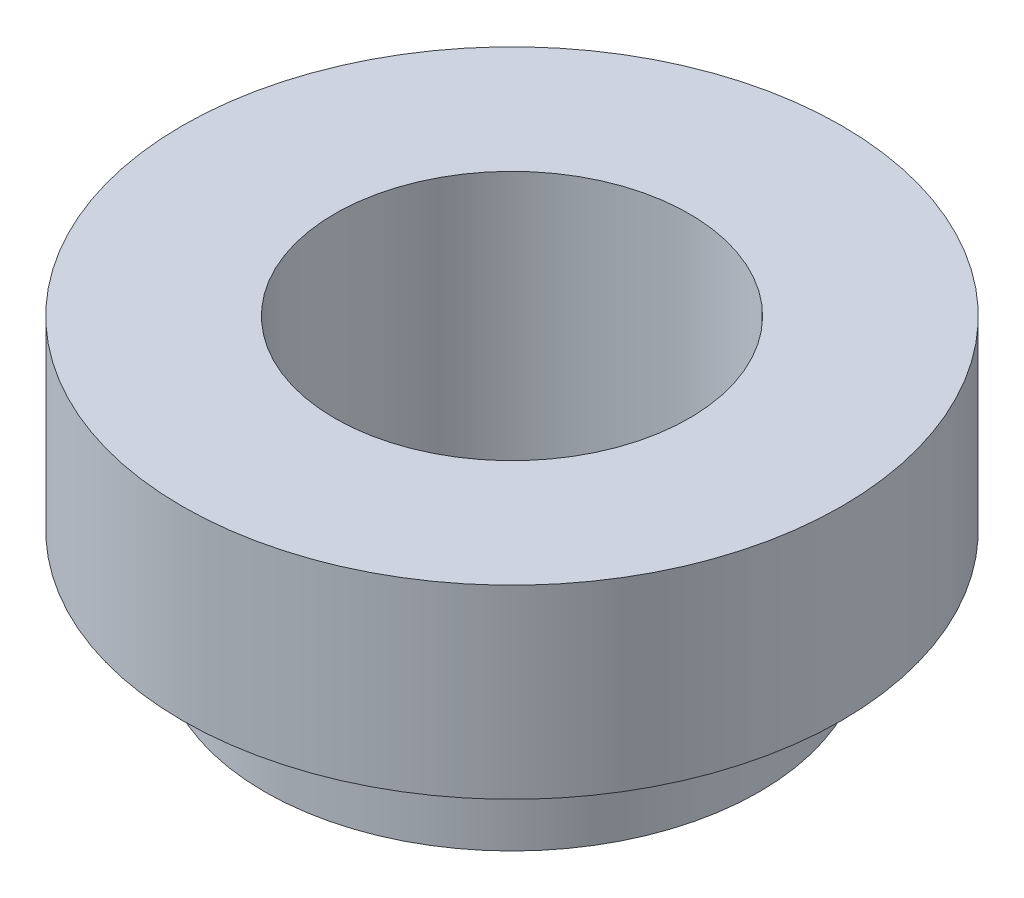
ISO-10303-21;
HEADER;
FILE_DESCRIPTION(('STEP AP214'),'2;1');
FILE_NAME('part.step','',(''),(''),'','','');
FILE_SCHEMA(('AUTOMOTIVE_DESIGN { 1 0 10303 214 1 1 1 1 }'));
ENDSEC;
DATA;
#1=APPLICATION_CONTEXT('core data for automotive mechanical design processes');
#2=APPLICATION_PROTOCOL_DEFINITION('international standard','automotive_design',2000,#1);
#3=PRODUCT_CONTEXT('',#1,'mechanical');
#4=PRODUCT('Part','Part','',(#3));
#5=PRODUCT_RELATED_PRODUCT_CATEGORY('part','',(#4));
#6=PRODUCT_DEFINITION_FORMATION('','',#4);
#7=PRODUCT_DEFINITION_CONTEXT('part definition',#1,'design');
#8=PRODUCT_DEFINITION('design','',#6,#7);
#9=PRODUCT_DEFINITION_SHAPE('','',#8);
#10=(LENGTH_UNIT() NAMED_UNIT(*) SI_UNIT(.MILLI.,.METRE.));
#11=(NAMED_UNIT(*) PLANE_ANGLE_UNIT() SI_UNIT($,.RADIAN.));
#12=(NAMED_UNIT(*) SI_UNIT($,.STERADIAN.) SOLID_ANGLE_UNIT());
#13=UNCERTAINTY_MEASURE_WITH_UNIT(LENGTH_MEASURE(1.E-05),#10,'distance_accuracy_value','');
#14=(GEOMETRIC_REPRESENTATION_CONTEXT(3) GLOBAL_UNCERTAINTY_ASSIGNED_CONTEXT((#13)) GLOBAL_UNIT_ASSIGNED_CONTEXT((#10,
#11,#12)) REPRESENTATION_CONTEXT('',''));
#15=CARTESIAN_POINT('',(0.,0.,0.));
#16=DIRECTION('',(0.,0.,1.));
#17=DIRECTION('',(1.,0.,0.));
#18=AXIS2_PLACEMENT_3D('',#15,#16,#17);
#19=CARTESIAN_POINT('',(0.,0.,0.));
#20=DIRECTION('',(0.,-1.,0.));
#21=DIRECTION('',(0.,0.,-1.));
#22=AXIS2_PLACEMENT_3D('',#19,#20,#21);
#23=PLANE('',#22);
#24=CARTESIAN_POINT('',(0.,0.,0.));
#25=DIRECTION('',(0.,1.,0.));
#26=DIRECTION('',(0.,0.,1.));
#27=AXIS2_PLACEMENT_3D('',#24,#25,#26);
#28=CIRCLE('',#27,4.3);
#29=CARTESIAN_POINT('',(0.,0.,4.3));
#30=VERTEX_POINT('',#29);
#31=EDGE_CURVE('E53',#30,#30,#28,.T.);
#32=ORIENTED_EDGE('',*,*,#31,.F.);
#33=EDGE_LOOP('',(#32));
#34=FACE_BOUND('',#33,.T.);
#35=CARTESIAN_POINT('',(0.,0.,0.));
#36=DIRECTION('',(0.,-1.,0.));
#37=DIRECTION('',(0.,0.,-1.));
#38=AXIS2_PLACEMENT_3D('',#35,#36,#37);
#39=CIRCLE('',#38,8.);
#40=CARTESIAN_POINT('',(0.,0.,-8.));
#41=VERTEX_POINT('',#40);
#42=EDGE_CURVE('E10',#41,#41,#39,.T.);
#43=ORIENTED_EDGE('',*,*,#42,.F.);
#44=EDGE_LOOP('',(#43));
#45=FACE_BOUND('',#44,.T.);
#46=ADVANCED_FACE('F33',(#34,#45),#23,.F.);
#47=CARTESIAN_POINT('',(0.,-55.,0.));
#48=DIRECTION('',(0.,-1.,0.));
#49=DIRECTION('',(0.,0.,-1.));
#50=AXIS2_PLACEMENT_3D('',#47,#48,#49);
#51=CYLINDRICAL_SURFACE('',#50,8.);
#52=CARTESIAN_POINT('',(0.,-4.5,0.));
#53=DIRECTION('',(0.,-1.,0.));
#54=DIRECTION('',(0.,0.,-1.));
#55=AXIS2_PLACEMENT_3D('',#52,#53,#54);
#56=CIRCLE('',#55,8.);
#57=CARTESIAN_POINT('',(0.,-4.5,-8.));
#58=VERTEX_POINT('',#57);
#59=EDGE_CURVE('E39',#58,#58,#56,.T.);
#60=ORIENTED_EDGE('',*,*,#59,.F.);
#61=EDGE_LOOP('',(#60));
#62=FACE_BOUND('',#61,.T.);
#63=ORIENTED_EDGE('',*,*,#42,.T.);
#64=EDGE_LOOP('',(#63));
#65=FACE_BOUND('',#64,.T.);
#66=ADVANCED_FACE('F70',(#62,#65),#51,.T.);
#67=CARTESIAN_POINT('',(-8.,-4.5,0.));
#68=DIRECTION('',(0.,1.,0.));
#69=DIRECTION('',(0.,0.,1.));
#70=AXIS2_PLACEMENT_3D('',#67,#68,#69);
#71=PLANE('',#70);
#72=CARTESIAN_POINT('',(0.,-4.5,0.));
#73=DIRECTION('',(0.,-1.,0.));
#74=DIRECTION('',(0.,0.,-1.));
#75=AXIS2_PLACEMENT_3D('',#72,#73,#74);
#76=CIRCLE('',#75,6.);
#77=CARTESIAN_POINT('',(0.,-4.5,-6.));
#78=VERTEX_POINT('',#77);
#79=EDGE_CURVE('E43',#78,#78,#76,.T.);
#80=ORIENTED_EDGE('',*,*,#79,.F.);
#81=EDGE_LOOP('',(#80));
#82=FACE_BOUND('',#81,.T.);
#83=ORIENTED_EDGE('',*,*,#59,.T.);
#84=EDGE_LOOP('',(#83));
#85=FACE_BOUND('',#84,.T.);
#86=ADVANCED_FACE('F74',(#82,#85),#71,.F.);
#87=CARTESIAN_POINT('',(0.,-55.,0.));
#88=DIRECTION('',(0.,-1.,0.));
#89=DIRECTION('',(0.,0.,-1.));
#90=AXIS2_PLACEMENT_3D('',#87,#88,#89);
#91=CYLINDRICAL_SURFACE('',#90,6.);
#92=CARTESIAN_POINT('',(0.,-7.,0.));
#93=DIRECTION('',(0.,-1.,0.));
#94=DIRECTION('',(0.,0.,-1.));
#95=AXIS2_PLACEMENT_3D('',#92,#93,#94);
#96=CIRCLE('',#95,6.);
#97=CARTESIAN_POINT('',(0.,-7.,-6.));
#98=VERTEX_POINT('',#97);
#99=EDGE_CURVE('E47',#98,#98,#96,.T.);
#100=ORIENTED_EDGE('',*,*,#99,.F.);
#101=EDGE_LOOP('',(#100));
#102=FACE_BOUND('',#101,.T.);
#103=ORIENTED_EDGE('',*,*,#79,.T.);
#104=EDGE_LOOP('',(#103));
#105=FACE_BOUND('',#104,.T.);
#106=ADVANCED_FACE('F79',(#102,#105),#91,.T.);
#107=CARTESIAN_POINT('',(-6.,-7.,0.));
#108=DIRECTION('',(0.,1.,0.));
#109=DIRECTION('',(0.,0.,1.));
#110=AXIS2_PLACEMENT_3D('',#107,#108,#109);
#111=PLANE('',#110);
#112=CARTESIAN_POINT('',(0.,-7.,0.));
#113=DIRECTION('',(0.,1.,0.));
#114=DIRECTION('',(0.,0.,1.));
#115=AXIS2_PLACEMENT_3D('',#112,#113,#114);
#116=CIRCLE('',#115,4.3);
#117=CARTESIAN_POINT('',(0.,-7.,4.3));
#118=VERTEX_POINT('',#117);
#119=EDGE_CURVE('E52',#118,#118,#116,.T.);
#120=ORIENTED_EDGE('',*,*,#119,.T.);
#121=EDGE_LOOP('',(#120));
#122=FACE_BOUND('',#121,.T.);
#123=ORIENTED_EDGE('',*,*,#99,.T.);
#124=EDGE_LOOP('',(#123));
#125=FACE_BOUND('',#124,.T.);
#126=ADVANCED_FACE('F59',(#122,#125),#111,.F.);
#127=CARTESIAN_POINT('',(0.,-7.,0.));
#128=DIRECTION('',(0.,1.,0.));
#129=DIRECTION('',(0.,0.,1.));
#130=AXIS2_PLACEMENT_3D('',#127,#128,#129);
#131=CYLINDRICAL_SURFACE('',#130,4.3);
#132=ORIENTED_EDGE('',*,*,#119,.F.);
#133=EDGE_LOOP('',(#132));
#134=FACE_BOUND('',#133,.T.);
#135=ORIENTED_EDGE('',*,*,#31,.T.);
#136=EDGE_LOOP('',(#135));
#137=FACE_BOUND('',#136,.T.);
#138=ADVANCED_FACE('F62',(#134,#137),#131,.F.);
#139=CLOSED_SHELL('',(#46,#66,#86,#106,#126,#138));
#140=MANIFOLD_SOLID_BREP('B2',#139);
#141=ADVANCED_BREP_SHAPE_REPRESENTATION('',(#18,#140),#14);
#142=SHAPE_DEFINITION_REPRESENTATION(#9,#141);
ENDSEC;
END-ISO-10303-21;
